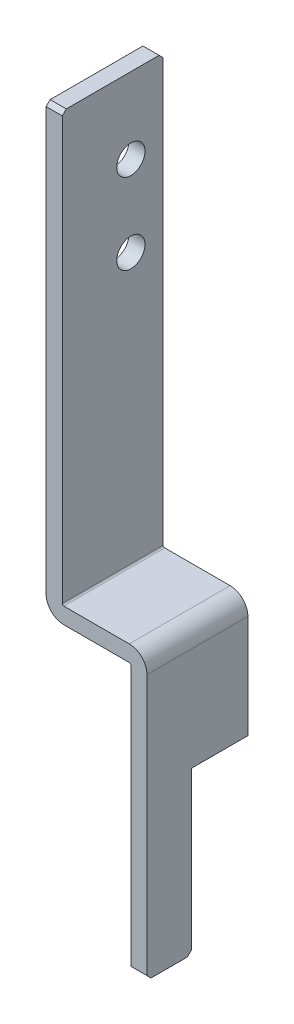
ISO-10303-21;
HEADER;
FILE_DESCRIPTION(('STEP AP214'),'2;1');
FILE_NAME('part.step','',(''),(''),'','','');
FILE_SCHEMA(('AUTOMOTIVE_DESIGN { 1 0 10303 214 1 1 1 1 }'));
ENDSEC;
DATA;
#1=APPLICATION_CONTEXT('core data for automotive mechanical design processes');
#2=APPLICATION_PROTOCOL_DEFINITION('international standard','automotive_design',2000,#1);
#3=PRODUCT_CONTEXT('',#1,'mechanical');
#4=PRODUCT('Part','Part','',(#3));
#5=PRODUCT_RELATED_PRODUCT_CATEGORY('part','',(#4));
#6=PRODUCT_DEFINITION_FORMATION('','',#4);
#7=PRODUCT_DEFINITION_CONTEXT('part definition',#1,'design');
#8=PRODUCT_DEFINITION('design','',#6,#7);
#9=PRODUCT_DEFINITION_SHAPE('','',#8);
#10=(LENGTH_UNIT() NAMED_UNIT(*) SI_UNIT(.MILLI.,.METRE.));
#11=(NAMED_UNIT(*) PLANE_ANGLE_UNIT() SI_UNIT($,.RADIAN.));
#12=(NAMED_UNIT(*) SI_UNIT($,.STERADIAN.) SOLID_ANGLE_UNIT());
#13=UNCERTAINTY_MEASURE_WITH_UNIT(LENGTH_MEASURE(1.E-05),#10,'distance_accuracy_value','');
#14=(GEOMETRIC_REPRESENTATION_CONTEXT(3) GLOBAL_UNCERTAINTY_ASSIGNED_CONTEXT((#13)) GLOBAL_UNIT_ASSIGNED_CONTEXT((#10,
#11,#12)) REPRESENTATION_CONTEXT('',''));
#15=CARTESIAN_POINT('',(0.,0.,0.));
#16=DIRECTION('',(0.,0.,1.));
#17=DIRECTION('',(1.,0.,0.));
#18=AXIS2_PLACEMENT_3D('',#15,#16,#17);
#19=CARTESIAN_POINT('',(18.5,-57.5,2.));
#20=DIRECTION('',(0.,-0.707106781186537,-0.707106781186558));
#21=DIRECTION('',(0.,0.707106781186558,-0.707106781186537));
#22=AXIS2_PLACEMENT_3D('',#19,#20,#21);
#23=PLANE('',#22);
#24=DIRECTION('',(0.,0.707106781186557,-0.707106781186538));
#25=VECTOR('',#24,1.);
#26=CARTESIAN_POINT('',(8.49999999999999,-58.,2.49999999999997));
#27=LINE('',#26,#25);
#28=CARTESIAN_POINT('',(8.49999999999999,-58.,2.49999999999997));
#29=VERTEX_POINT('',#28);
#30=CARTESIAN_POINT('',(8.49999999999999,-57.5,2.));
#31=VERTEX_POINT('',#30);
#32=EDGE_CURVE('E272',#29,#31,#27,.T.);
#33=ORIENTED_EDGE('',*,*,#32,.T.);
#34=DIRECTION('',(1.,0.,0.));
#35=VECTOR('',#34,1.);
#36=CARTESIAN_POINT('',(18.5,-57.5,2.));
#37=LINE('',#36,#35);
#38=CARTESIAN_POINT('',(10.5,-57.5,2.));
#39=VERTEX_POINT('',#38);
#40=EDGE_CURVE('E255',#31,#39,#37,.T.);
#41=ORIENTED_EDGE('',*,*,#40,.T.);
#42=DIRECTION('',(0.,0.707106781186558,-0.707106781186537));
#43=VECTOR('',#42,1.);
#44=CARTESIAN_POINT('',(10.5,-57.5,2.));
#45=LINE('',#44,#43);
#46=CARTESIAN_POINT('',(10.5,-58.,2.49999999999997));
#47=VERTEX_POINT('',#46);
#48=EDGE_CURVE('E268',#39,#47,#45,.F.);
#49=ORIENTED_EDGE('',*,*,#48,.T.);
#50=DIRECTION('',(1.,0.,0.));
#51=VECTOR('',#50,1.);
#52=CARTESIAN_POINT('',(10.5,-58.,2.49999999999997));
#53=LINE('',#52,#51);
#54=EDGE_CURVE('E287',#29,#47,#53,.T.);
#55=ORIENTED_EDGE('',*,*,#54,.F.);
#56=EDGE_LOOP('',(#33,#41,#49,#55));
#57=FACE_BOUND('',#56,.T.);
#58=ADVANCED_FACE('F17',(#57),#23,.T.);
#59=CARTESIAN_POINT('',(10.5,-58.,7.));
#60=DIRECTION('',(0.,0.707106781186543,-0.707106781186552));
#61=DIRECTION('',(0.,0.707106781186552,0.707106781186543));
#62=AXIS2_PLACEMENT_3D('',#59,#60,#61);
#63=PLANE('',#62);
#64=DIRECTION('',(1.,0.,0.));
#65=VECTOR('',#64,1.);
#66=CARTESIAN_POINT('',(10.5,-57.5,7.5));
#67=LINE('',#66,#65);
#68=CARTESIAN_POINT('',(8.49999999999999,-57.5,7.49999999999999));
#69=VERTEX_POINT('',#68);
#70=CARTESIAN_POINT('',(10.5,-57.5,7.5));
#71=VERTEX_POINT('',#70);
#72=EDGE_CURVE('E150',#69,#71,#67,.T.);
#73=ORIENTED_EDGE('',*,*,#72,.F.);
#74=DIRECTION('',(0.,-0.707106781186552,-0.707106781186542));
#75=VECTOR('',#74,1.);
#76=CARTESIAN_POINT('',(8.49999999999999,-57.5,7.5));
#77=LINE('',#76,#75);
#78=CARTESIAN_POINT('',(8.49999999999999,-58.,7.));
#79=VERTEX_POINT('',#78);
#80=EDGE_CURVE('E145',#69,#79,#77,.T.);
#81=ORIENTED_EDGE('',*,*,#80,.T.);
#82=DIRECTION('',(1.,0.,0.));
#83=VECTOR('',#82,1.);
#84=CARTESIAN_POINT('',(10.5,-58.,7.));
#85=LINE('',#84,#83);
#86=CARTESIAN_POINT('',(10.5,-58.,7.));
#87=VERTEX_POINT('',#86);
#88=EDGE_CURVE('E277',#87,#79,#85,.F.);
#89=ORIENTED_EDGE('',*,*,#88,.F.);
#90=DIRECTION('',(0.,0.707106781186552,0.707106781186543));
#91=VECTOR('',#90,1.);
#92=CARTESIAN_POINT('',(10.5,-58.,7.));
#93=LINE('',#92,#91);
#94=EDGE_CURVE('E266',#71,#87,#93,.F.);
#95=ORIENTED_EDGE('',*,*,#94,.F.);
#96=EDGE_LOOP('',(#73,#81,#89,#95));
#97=FACE_BOUND('',#96,.T.);
#98=ADVANCED_FACE('F300',(#97),#63,.F.);
#99=CARTESIAN_POINT('',(8.5,0.,0.));
#100=DIRECTION('',(1.,0.,0.));
#101=DIRECTION('',(0.,1.,0.));
#102=AXIS2_PLACEMENT_3D('',#99,#100,#101);
#103=PLANE('',#102);
#104=ORIENTED_EDGE('',*,*,#32,.F.);
#105=DIRECTION('',(0.,0.,1.));
#106=VECTOR('',#105,1.);
#107=CARTESIAN_POINT('',(8.49999999999999,-58.,5.));
#108=LINE('',#107,#106);
#109=EDGE_CURVE('E284',#79,#29,#108,.F.);
#110=ORIENTED_EDGE('',*,*,#109,.F.);
#111=ORIENTED_EDGE('',*,*,#80,.F.);
#112=DIRECTION('',(0.,1.,0.));
#113=VECTOR('',#112,1.);
#114=CARTESIAN_POINT('',(8.49999999999999,-25.,7.5));
#115=LINE('',#114,#113);
#116=CARTESIAN_POINT('',(8.49999999999999,-25.2,7.5));
#117=VERTEX_POINT('',#116);
#118=EDGE_CURVE('E138',#117,#69,#115,.F.);
#119=ORIENTED_EDGE('',*,*,#118,.F.);
#120=DIRECTION('',(0.,0.,1.));
#121=VECTOR('',#120,1.);
#122=CARTESIAN_POINT('',(8.49999999999999,-25.2,5.));
#123=LINE('',#122,#121);
#124=CARTESIAN_POINT('',(8.49999999999999,-25.2,-5.));
#125=VERTEX_POINT('',#124);
#126=EDGE_CURVE('E142',#117,#125,#123,.F.);
#127=ORIENTED_EDGE('',*,*,#126,.T.);
#128=DIRECTION('',(0.,1.,0.));
#129=VECTOR('',#128,1.);
#130=CARTESIAN_POINT('',(8.49999999999999,-58.,-5.));
#131=LINE('',#130,#129);
#132=CARTESIAN_POINT('',(8.49999999999999,-38.,-5.));
#133=VERTEX_POINT('',#132);
#134=EDGE_CURVE('E160',#133,#125,#131,.T.);
#135=ORIENTED_EDGE('',*,*,#134,.F.);
#136=DIRECTION('',(0.,0.,1.));
#137=VECTOR('',#136,1.);
#138=CARTESIAN_POINT('',(8.49999999999999,-38.,2.));
#139=LINE('',#138,#137);
#140=CARTESIAN_POINT('',(8.49999999999999,-38.,2.));
#141=VERTEX_POINT('',#140);
#142=EDGE_CURVE('E250',#133,#141,#139,.T.);
#143=ORIENTED_EDGE('',*,*,#142,.T.);
#144=DIRECTION('',(0.,-1.,0.));
#145=VECTOR('',#144,1.);
#146=CARTESIAN_POINT('',(8.49999999999999,-38.,2.));
#147=LINE('',#146,#145);
#148=EDGE_CURVE('E258',#141,#31,#147,.T.);
#149=ORIENTED_EDGE('',*,*,#148,.T.);
#150=EDGE_LOOP('',(#104,#110,#111,#119,#127,#135,#143,#149));
#151=FACE_BOUND('',#150,.T.);
#152=ADVANCED_FACE('F140',(#151),#103,.F.);
#153=CARTESIAN_POINT('',(10.5,-58.,5.));
#154=DIRECTION('',(0.,-1.,0.));
#155=DIRECTION('',(1.,0.,0.));
#156=AXIS2_PLACEMENT_3D('',#153,#154,#155);
#157=PLANE('',#156);
#158=DIRECTION('',(0.,0.,1.));
#159=VECTOR('',#158,1.);
#160=CARTESIAN_POINT('',(10.5,-58.,0.));
#161=LINE('',#160,#159);
#162=EDGE_CURVE('E167',#87,#47,#161,.F.);
#163=ORIENTED_EDGE('',*,*,#162,.F.);
#164=ORIENTED_EDGE('',*,*,#88,.T.);
#165=ORIENTED_EDGE('',*,*,#109,.T.);
#166=ORIENTED_EDGE('',*,*,#54,.T.);
#167=EDGE_LOOP('',(#163,#164,#165,#166));
#168=FACE_BOUND('',#167,.T.);
#169=ADVANCED_FACE('F298',(#168),#157,.T.);
#170=CARTESIAN_POINT('',(18.5,-38.,2.));
#171=DIRECTION('',(0.,0.,1.));
#172=DIRECTION('',(0.,-1.,0.));
#173=AXIS2_PLACEMENT_3D('',#170,#171,#172);
#174=PLANE('',#173);
#175=ORIENTED_EDGE('',*,*,#40,.F.);
#176=ORIENTED_EDGE('',*,*,#148,.F.);
#177=DIRECTION('',(-1.,0.,0.));
#178=VECTOR('',#177,1.);
#179=CARTESIAN_POINT('',(18.5,-38.,2.));
#180=LINE('',#179,#178);
#181=CARTESIAN_POINT('',(10.5,-38.,2.));
#182=VERTEX_POINT('',#181);
#183=EDGE_CURVE('E151',#141,#182,#180,.F.);
#184=ORIENTED_EDGE('',*,*,#183,.T.);
#185=DIRECTION('',(0.,1.,0.));
#186=VECTOR('',#185,1.);
#187=CARTESIAN_POINT('',(10.5,0.,2.));
#188=LINE('',#187,#186);
#189=EDGE_CURVE('E169',#39,#182,#188,.T.);
#190=ORIENTED_EDGE('',*,*,#189,.F.);
#191=EDGE_LOOP('',(#175,#176,#184,#190));
#192=FACE_BOUND('',#191,.T.);
#193=ADVANCED_FACE('F309',(#192),#174,.F.);
#194=CARTESIAN_POINT('',(18.5,-38.,2.));
#195=DIRECTION('',(0.,1.,0.));
#196=DIRECTION('',(-1.,0.,0.));
#197=AXIS2_PLACEMENT_3D('',#194,#195,#196);
#198=PLANE('',#197);
#199=DIRECTION('',(0.,0.,1.));
#200=VECTOR('',#199,1.);
#201=CARTESIAN_POINT('',(10.5,-38.,0.));
#202=LINE('',#201,#200);
#203=CARTESIAN_POINT('',(10.5,-38.,-5.));
#204=VERTEX_POINT('',#203);
#205=EDGE_CURVE('E174',#182,#204,#202,.F.);
#206=ORIENTED_EDGE('',*,*,#205,.F.);
#207=ORIENTED_EDGE('',*,*,#183,.F.);
#208=ORIENTED_EDGE('',*,*,#142,.F.);
#209=DIRECTION('',(1.,0.,0.));
#210=VECTOR('',#209,1.);
#211=CARTESIAN_POINT('',(10.5,-38.,-5.));
#212=LINE('',#211,#210);
#213=EDGE_CURVE('E235',#204,#133,#212,.F.);
#214=ORIENTED_EDGE('',*,*,#213,.F.);
#215=EDGE_LOOP('',(#206,#207,#208,#214));
#216=FACE_BOUND('',#215,.T.);
#217=ADVANCED_FACE('F312',(#216),#198,.F.);
#218=CARTESIAN_POINT('',(8.3,-25.2,5.));
#219=DIRECTION('',(0.,0.,1.));
#220=DIRECTION('',(1.,0.,0.));
#221=AXIS2_PLACEMENT_3D('',#218,#219,#220);
#222=CYLINDRICAL_SURFACE('',#221,0.199999999999999);
#223=CARTESIAN_POINT('',(8.3,-25.2,-5.));
#224=DIRECTION('',(0.,0.,1.));
#225=DIRECTION('',(1.,0.,0.));
#226=AXIS2_PLACEMENT_3D('',#223,#224,#225);
#227=CIRCLE('',#226,0.199999999999999);
#228=CARTESIAN_POINT('',(8.3,-25.,-5.));
#229=VERTEX_POINT('',#228);
#230=EDGE_CURVE('E159',#125,#229,#227,.T.);
#231=ORIENTED_EDGE('',*,*,#230,.F.);
#232=ORIENTED_EDGE('',*,*,#126,.F.);
#233=CARTESIAN_POINT('',(8.3,-25.2,7.5));
#234=DIRECTION('',(0.,0.,1.));
#235=DIRECTION('',(1.,0.,0.));
#236=AXIS2_PLACEMENT_3D('',#233,#234,#235);
#237=CIRCLE('',#236,0.199999999999999);
#238=CARTESIAN_POINT('',(8.3,-25.,7.5));
#239=VERTEX_POINT('',#238);
#240=EDGE_CURVE('E20',#117,#239,#237,.T.);
#241=ORIENTED_EDGE('',*,*,#240,.T.);
#242=DIRECTION('',(0.,0.,1.));
#243=VECTOR('',#242,1.);
#244=CARTESIAN_POINT('',(8.3,-25.,0.));
#245=LINE('',#244,#243);
#246=EDGE_CURVE('E218',#229,#239,#245,.T.);
#247=ORIENTED_EDGE('',*,*,#246,.F.);
#248=EDGE_LOOP('',(#231,#232,#241,#247));
#249=FACE_BOUND('',#248,.T.);
#250=ADVANCED_FACE('F156',(#249),#222,.F.);
#251=CARTESIAN_POINT('',(10.5,0.,0.));
#252=DIRECTION('',(1.,0.,0.));
#253=DIRECTION('',(0.,1.,0.));
#254=AXIS2_PLACEMENT_3D('',#251,#252,#253);
#255=PLANE('',#254);
#256=DIRECTION('',(0.,1.,0.));
#257=VECTOR('',#256,1.);
#258=CARTESIAN_POINT('',(10.5,0.,7.5));
#259=LINE('',#258,#257);
#260=CARTESIAN_POINT('',(10.5,-25.2,7.5));
#261=VERTEX_POINT('',#260);
#262=EDGE_CURVE('E219',#261,#71,#259,.F.);
#263=ORIENTED_EDGE('',*,*,#262,.T.);
#264=ORIENTED_EDGE('',*,*,#94,.T.);
#265=ORIENTED_EDGE('',*,*,#162,.T.);
#266=ORIENTED_EDGE('',*,*,#48,.F.);
#267=ORIENTED_EDGE('',*,*,#189,.T.);
#268=ORIENTED_EDGE('',*,*,#205,.T.);
#269=DIRECTION('',(0.,1.,0.));
#270=VECTOR('',#269,1.);
#271=CARTESIAN_POINT('',(10.5,0.,-5.));
#272=LINE('',#271,#270);
#273=CARTESIAN_POINT('',(10.5,-25.2,-5.));
#274=VERTEX_POINT('',#273);
#275=EDGE_CURVE('E225',#204,#274,#272,.T.);
#276=ORIENTED_EDGE('',*,*,#275,.T.);
#277=DIRECTION('',(0.,0.,1.));
#278=VECTOR('',#277,1.);
#279=CARTESIAN_POINT('',(10.5,-25.2,5.));
#280=LINE('',#279,#278);
#281=EDGE_CURVE('E215',#261,#274,#280,.F.);
#282=ORIENTED_EDGE('',*,*,#281,.F.);
#283=EDGE_LOOP('',(#263,#264,#265,#266,#267,#268,#276,#282));
#284=FACE_BOUND('',#283,.T.);
#285=ADVANCED_FACE('F306',(#284),#255,.T.);
#286=CARTESIAN_POINT('',(0.,-25.,0.));
#287=DIRECTION('',(0.,-1.,0.));
#288=DIRECTION('',(1.,0.,0.));
#289=AXIS2_PLACEMENT_3D('',#286,#287,#288);
#290=PLANE('',#289);
#291=DIRECTION('',(1.,0.,0.));
#292=VECTOR('',#291,1.);
#293=CARTESIAN_POINT('',(10.5,-25.,7.5));
#294=LINE('',#293,#292);
#295=CARTESIAN_POINT('',(0.199999999999996,-25.,7.5));
#296=VERTEX_POINT('',#295);
#297=EDGE_CURVE('E166',#296,#239,#294,.T.);
#298=ORIENTED_EDGE('',*,*,#297,.F.);
#299=DIRECTION('',(0.,0.,-1.));
#300=VECTOR('',#299,1.);
#301=CARTESIAN_POINT('',(0.199999999999992,-25.,-5.));
#302=LINE('',#301,#300);
#303=CARTESIAN_POINT('',(0.199999999999996,-25.,-5.));
#304=VERTEX_POINT('',#303);
#305=EDGE_CURVE('E214',#304,#296,#302,.F.);
#306=ORIENTED_EDGE('',*,*,#305,.F.);
#307=DIRECTION('',(-1.,0.,0.));
#308=VECTOR('',#307,1.);
#309=CARTESIAN_POINT('',(0.,-25.,-5.));
#310=LINE('',#309,#308);
#311=EDGE_CURVE('E365',#229,#304,#310,.T.);
#312=ORIENTED_EDGE('',*,*,#311,.F.);
#313=ORIENTED_EDGE('',*,*,#246,.T.);
#314=EDGE_LOOP('',(#298,#306,#312,#313));
#315=FACE_BOUND('',#314,.T.);
#316=ADVANCED_FACE('F427',(#315),#290,.T.);
#317=CARTESIAN_POINT('',(8.3,-25.2,5.));
#318=DIRECTION('',(0.,0.,1.));
#319=DIRECTION('',(1.,0.,0.));
#320=AXIS2_PLACEMENT_3D('',#317,#318,#319);
#321=CYLINDRICAL_SURFACE('',#320,2.2);
#322=ORIENTED_EDGE('',*,*,#281,.T.);
#323=CARTESIAN_POINT('',(8.3,-25.2,-5.));
#324=DIRECTION('',(0.,0.,1.));
#325=DIRECTION('',(1.,0.,0.));
#326=AXIS2_PLACEMENT_3D('',#323,#324,#325);
#327=CIRCLE('',#326,2.2);
#328=CARTESIAN_POINT('',(8.3,-23.,-5.));
#329=VERTEX_POINT('',#328);
#330=EDGE_CURVE('E211',#274,#329,#327,.T.);
#331=ORIENTED_EDGE('',*,*,#330,.T.);
#332=DIRECTION('',(0.,0.,1.));
#333=VECTOR('',#332,1.);
#334=CARTESIAN_POINT('',(8.3,-23.,0.));
#335=LINE('',#334,#333);
#336=CARTESIAN_POINT('',(8.3,-23.,7.5));
#337=VERTEX_POINT('',#336);
#338=EDGE_CURVE('E323',#329,#337,#335,.T.);
#339=ORIENTED_EDGE('',*,*,#338,.T.);
#340=CARTESIAN_POINT('',(8.3,-25.2,7.5));
#341=DIRECTION('',(0.,0.,1.));
#342=DIRECTION('',(1.,0.,0.));
#343=AXIS2_PLACEMENT_3D('',#340,#341,#342);
#344=CIRCLE('',#343,2.2);
#345=EDGE_CURVE('E216',#337,#261,#344,.F.);
#346=ORIENTED_EDGE('',*,*,#345,.T.);
#347=EDGE_LOOP('',(#322,#331,#339,#346));
#348=FACE_BOUND('',#347,.T.);
#349=ADVANCED_FACE('F321',(#348),#321,.T.);
#350=CARTESIAN_POINT('',(0.2,-22.8,-5.));
#351=DIRECTION('',(0.,0.,-1.));
#352=DIRECTION('',(-1.,0.,0.));
#353=AXIS2_PLACEMENT_3D('',#350,#351,#352);
#354=CYLINDRICAL_SURFACE('',#353,2.2);
#355=ORIENTED_EDGE('',*,*,#305,.T.);
#356=CARTESIAN_POINT('',(0.2,-22.8,7.5));
#357=DIRECTION('',(0.,0.,-1.));
#358=DIRECTION('',(-1.,0.,0.));
#359=AXIS2_PLACEMENT_3D('',#356,#357,#358);
#360=CIRCLE('',#359,2.2);
#361=CARTESIAN_POINT('',(-2.,-22.8,7.5));
#362=VERTEX_POINT('',#361);
#363=EDGE_CURVE('E205',#362,#296,#360,.F.);
#364=ORIENTED_EDGE('',*,*,#363,.F.);
#365=DIRECTION('',(0.,0.,-1.));
#366=VECTOR('',#365,1.);
#367=CARTESIAN_POINT('',(-2.,-22.8,0.));
#368=LINE('',#367,#366);
#369=CARTESIAN_POINT('',(-2.,-22.8,-5.));
#370=VERTEX_POINT('',#369);
#371=EDGE_CURVE('E355',#362,#370,#368,.T.);
#372=ORIENTED_EDGE('',*,*,#371,.T.);
#373=CARTESIAN_POINT('',(0.2,-22.8,-5.));
#374=DIRECTION('',(0.,0.,-1.));
#375=DIRECTION('',(-1.,0.,0.));
#376=AXIS2_PLACEMENT_3D('',#373,#374,#375);
#377=CIRCLE('',#376,2.2);
#378=EDGE_CURVE('E201',#370,#304,#377,.F.);
#379=ORIENTED_EDGE('',*,*,#378,.T.);
#380=EDGE_LOOP('',(#355,#364,#372,#379));
#381=FACE_BOUND('',#380,.T.);
#382=ADVANCED_FACE('F421',(#381),#354,.T.);
#383=CARTESIAN_POINT('',(-2.,30.,7.));
#384=DIRECTION('',(0.,-0.707106781186548,-0.707106781186548));
#385=DIRECTION('',(0.,0.707106781186548,-0.707106781186548));
#386=AXIS2_PLACEMENT_3D('',#383,#384,#385);
#387=PLANE('',#386);
#388=DIRECTION('',(1.,0.,0.));
#389=VECTOR('',#388,1.);
#390=CARTESIAN_POINT('',(-2.,29.5,7.50000000000001));
#391=LINE('',#390,#389);
#392=CARTESIAN_POINT('',(0.,29.5,7.50000000000001));
#393=VERTEX_POINT('',#392);
#394=CARTESIAN_POINT('',(-2.,29.5,7.50000000000001));
#395=VERTEX_POINT('',#394);
#396=EDGE_CURVE('E358',#393,#395,#391,.F.);
#397=ORIENTED_EDGE('',*,*,#396,.F.);
#398=DIRECTION('',(0.,0.707106781186548,-0.707106781186548));
#399=VECTOR('',#398,1.);
#400=CARTESIAN_POINT('',(0.,30.,7.));
#401=LINE('',#400,#399);
#402=CARTESIAN_POINT('',(0.,30.,7.));
#403=VERTEX_POINT('',#402);
#404=EDGE_CURVE('E210',#403,#393,#401,.F.);
#405=ORIENTED_EDGE('',*,*,#404,.F.);
#406=DIRECTION('',(1.,0.,0.));
#407=VECTOR('',#406,1.);
#408=CARTESIAN_POINT('',(-2.,30.,7.));
#409=LINE('',#408,#407);
#410=CARTESIAN_POINT('',(-2.,30.,7.00000000000001));
#411=VERTEX_POINT('',#410);
#412=EDGE_CURVE('E373',#411,#403,#409,.T.);
#413=ORIENTED_EDGE('',*,*,#412,.F.);
#414=DIRECTION('',(0.,-0.707106781186547,0.707106781186548));
#415=VECTOR('',#414,1.);
#416=CARTESIAN_POINT('',(-2.,30.,7.));
#417=LINE('',#416,#415);
#418=EDGE_CURVE('E353',#411,#395,#417,.T.);
#419=ORIENTED_EDGE('',*,*,#418,.T.);
#420=EDGE_LOOP('',(#397,#405,#413,#419));
#421=FACE_BOUND('',#420,.T.);
#422=ADVANCED_FACE('F387',(#421),#387,.F.);
#423=CARTESIAN_POINT('',(0.,-23.,0.));
#424=DIRECTION('',(0.,-1.,0.));
#425=DIRECTION('',(1.,0.,0.));
#426=AXIS2_PLACEMENT_3D('',#423,#424,#425);
#427=PLANE('',#426);
#428=DIRECTION('',(1.,0.,0.));
#429=VECTOR('',#428,1.);
#430=CARTESIAN_POINT('',(0.,-23.,-5.));
#431=LINE('',#430,#429);
#432=CARTESIAN_POINT('',(0.199999999999995,-23.,-5.));
#433=VERTEX_POINT('',#432);
#434=EDGE_CURVE('E330',#433,#329,#431,.T.);
#435=ORIENTED_EDGE('',*,*,#434,.F.);
#436=DIRECTION('',(0.,0.,-1.));
#437=VECTOR('',#436,1.);
#438=CARTESIAN_POINT('',(0.199999999999999,-23.,-5.));
#439=LINE('',#438,#437);
#440=CARTESIAN_POINT('',(0.199999999999997,-23.,7.5));
#441=VERTEX_POINT('',#440);
#442=EDGE_CURVE('E192',#433,#441,#439,.F.);
#443=ORIENTED_EDGE('',*,*,#442,.T.);
#444=DIRECTION('',(1.,0.,0.));
#445=VECTOR('',#444,1.);
#446=CARTESIAN_POINT('',(0.,-23.,7.5));
#447=LINE('',#446,#445);
#448=EDGE_CURVE('E207',#337,#441,#447,.F.);
#449=ORIENTED_EDGE('',*,*,#448,.F.);
#450=ORIENTED_EDGE('',*,*,#338,.F.);
#451=EDGE_LOOP('',(#435,#443,#449,#450));
#452=FACE_BOUND('',#451,.T.);
#453=ADVANCED_FACE('F407',(#452),#427,.F.);
#454=CARTESIAN_POINT('',(-2.,0.,0.));
#455=DIRECTION('',(1.,0.,0.));
#456=DIRECTION('',(0.,0.,-1.));
#457=AXIS2_PLACEMENT_3D('',#454,#455,#456);
#458=PLANE('',#457);
#459=ORIENTED_EDGE('',*,*,#418,.F.);
#460=DIRECTION('',(0.,0.,1.));
#461=VECTOR('',#460,1.);
#462=CARTESIAN_POINT('',(-2.,30.,5.));
#463=LINE('',#462,#461);
#464=CARTESIAN_POINT('',(-2.,30.,-4.49999999999997));
#465=VERTEX_POINT('',#464);
#466=EDGE_CURVE('E197',#465,#411,#463,.T.);
#467=ORIENTED_EDGE('',*,*,#466,.F.);
#468=DIRECTION('',(0.,-0.707106781186538,-0.707106781186557));
#469=VECTOR('',#468,1.);
#470=CARTESIAN_POINT('',(-2.,29.5,-5.));
#471=LINE('',#470,#469);
#472=CARTESIAN_POINT('',(-2.,29.5,-5.));
#473=VERTEX_POINT('',#472);
#474=EDGE_CURVE('E204',#465,#473,#471,.T.);
#475=ORIENTED_EDGE('',*,*,#474,.T.);
#476=DIRECTION('',(0.,1.,0.));
#477=VECTOR('',#476,1.);
#478=CARTESIAN_POINT('',(-2.,30.,-5.));
#479=LINE('',#478,#477);
#480=EDGE_CURVE('E599',#370,#473,#479,.T.);
#481=ORIENTED_EDGE('',*,*,#480,.F.);
#482=ORIENTED_EDGE('',*,*,#371,.F.);
#483=DIRECTION('',(0.,-1.,0.));
#484=VECTOR('',#483,1.);
#485=CARTESIAN_POINT('',(-2.,30.,7.50000000000001));
#486=LINE('',#485,#484);
#487=EDGE_CURVE('E193',#395,#362,#486,.T.);
#488=ORIENTED_EDGE('',*,*,#487,.F.);
#489=EDGE_LOOP('',(#459,#467,#475,#481,#482,#488));
#490=FACE_BOUND('',#489,.T.);
#491=CARTESIAN_POINT('',(-2.,20.6000000000001,-0.999999999999987));
#492=DIRECTION('',(-1.,0.,0.));
#493=DIRECTION('',(0.,0.,1.));
#494=AXIS2_PLACEMENT_3D('',#491,#492,#493);
#495=CIRCLE('',#494,1.75);
#496=CARTESIAN_POINT('',(-2.,20.6000000000001,0.750000000000013));
#497=VERTEX_POINT('',#496);
#498=EDGE_CURVE('E194',#497,#497,#495,.F.);
#499=ORIENTED_EDGE('',*,*,#498,.T.);
#500=EDGE_LOOP('',(#499));
#501=FACE_BOUND('',#500,.T.);
#502=CARTESIAN_POINT('',(-2.,10.6000000000001,-0.999999999999987));
#503=DIRECTION('',(-1.,0.,0.));
#504=DIRECTION('',(0.,0.,1.));
#505=AXIS2_PLACEMENT_3D('',#502,#503,#504);
#506=CIRCLE('',#505,1.75);
#507=CARTESIAN_POINT('',(-2.,10.6000000000001,0.750000000000013));
#508=VERTEX_POINT('',#507);
#509=EDGE_CURVE('E198',#508,#508,#506,.F.);
#510=ORIENTED_EDGE('',*,*,#509,.T.);
#511=EDGE_LOOP('',(#510));
#512=FACE_BOUND('',#511,.T.);
#513=ADVANCED_FACE('F405',(#490,#501,#512),#458,.F.);
#514=CARTESIAN_POINT('',(-2.,29.5,-5.));
#515=DIRECTION('',(0.,-0.707106781186557,0.707106781186538));
#516=DIRECTION('',(0.,-0.707106781186538,-0.707106781186557));
#517=AXIS2_PLACEMENT_3D('',#514,#515,#516);
#518=PLANE('',#517);
#519=DIRECTION('',(1.,0.,0.));
#520=VECTOR('',#519,1.);
#521=CARTESIAN_POINT('',(-2.,30.,-4.49999999999997));
#522=LINE('',#521,#520);
#523=CARTESIAN_POINT('',(0.,30.,-4.49999999999997));
#524=VERTEX_POINT('',#523);
#525=EDGE_CURVE('E361',#524,#465,#522,.F.);
#526=ORIENTED_EDGE('',*,*,#525,.F.);
#527=DIRECTION('',(0.,-0.707106781186538,-0.707106781186557));
#528=VECTOR('',#527,1.);
#529=CARTESIAN_POINT('',(0.,29.5,-5.));
#530=LINE('',#529,#528);
#531=CARTESIAN_POINT('',(0.,29.5,-5.));
#532=VERTEX_POINT('',#531);
#533=EDGE_CURVE('E35',#532,#524,#530,.F.);
#534=ORIENTED_EDGE('',*,*,#533,.F.);
#535=DIRECTION('',(1.,0.,0.));
#536=VECTOR('',#535,1.);
#537=CARTESIAN_POINT('',(-2.,29.5,-5.));
#538=LINE('',#537,#536);
#539=EDGE_CURVE('E189',#473,#532,#538,.T.);
#540=ORIENTED_EDGE('',*,*,#539,.F.);
#541=ORIENTED_EDGE('',*,*,#474,.F.);
#542=EDGE_LOOP('',(#526,#534,#540,#541));
#543=FACE_BOUND('',#542,.T.);
#544=ADVANCED_FACE('F401',(#543),#518,.F.);
#545=CARTESIAN_POINT('',(8.,10.6000000000001,-0.999999999999987));
#546=DIRECTION('',(-1.,0.,0.));
#547=DIRECTION('',(0.,0.,1.));
#548=AXIS2_PLACEMENT_3D('',#545,#546,#547);
#549=CYLINDRICAL_SURFACE('',#548,1.75);
#550=CARTESIAN_POINT('',(0.,10.6000000000001,-0.999999999999987));
#551=DIRECTION('',(-1.,0.,0.));
#552=DIRECTION('',(0.,0.,1.));
#553=AXIS2_PLACEMENT_3D('',#550,#551,#552);
#554=CIRCLE('',#553,1.75);
#555=CARTESIAN_POINT('',(0.,10.6000000000001,0.750000000000013));
#556=VERTEX_POINT('',#555);
#557=EDGE_CURVE('E186',#556,#556,#554,.T.);
#558=ORIENTED_EDGE('',*,*,#557,.F.);
#559=EDGE_LOOP('',(#558));
#560=FACE_BOUND('',#559,.T.);
#561=ORIENTED_EDGE('',*,*,#509,.F.);
#562=EDGE_LOOP('',(#561));
#563=FACE_BOUND('',#562,.T.);
#564=ADVANCED_FACE('F397',(#560,#563),#549,.F.);
#565=CARTESIAN_POINT('',(8.,20.6000000000001,-0.999999999999987));
#566=DIRECTION('',(-1.,0.,0.));
#567=DIRECTION('',(0.,0.,1.));
#568=AXIS2_PLACEMENT_3D('',#565,#566,#567);
#569=CYLINDRICAL_SURFACE('',#568,1.75);
#570=CARTESIAN_POINT('',(0.,20.6000000000001,-0.999999999999987));
#571=DIRECTION('',(-1.,0.,0.));
#572=DIRECTION('',(0.,0.,1.));
#573=AXIS2_PLACEMENT_3D('',#570,#571,#572);
#574=CIRCLE('',#573,1.75);
#575=CARTESIAN_POINT('',(0.,20.6000000000001,0.750000000000013));
#576=VERTEX_POINT('',#575);
#577=EDGE_CURVE('E182',#576,#576,#574,.T.);
#578=ORIENTED_EDGE('',*,*,#577,.F.);
#579=EDGE_LOOP('',(#578));
#580=FACE_BOUND('',#579,.T.);
#581=ORIENTED_EDGE('',*,*,#498,.F.);
#582=EDGE_LOOP('',(#581));
#583=FACE_BOUND('',#582,.T.);
#584=ADVANCED_FACE('F400',(#580,#583),#569,.F.);
#585=CARTESIAN_POINT('',(-2.,30.,5.));
#586=DIRECTION('',(0.,1.,0.));
#587=DIRECTION('',(0.,0.,1.));
#588=AXIS2_PLACEMENT_3D('',#585,#586,#587);
#589=PLANE('',#588);
#590=DIRECTION('',(0.,0.,-1.));
#591=VECTOR('',#590,1.);
#592=CARTESIAN_POINT('',(0.,30.,0.));
#593=LINE('',#592,#591);
#594=EDGE_CURVE('E185',#524,#403,#593,.F.);
#595=ORIENTED_EDGE('',*,*,#594,.F.);
#596=ORIENTED_EDGE('',*,*,#525,.T.);
#597=ORIENTED_EDGE('',*,*,#466,.T.);
#598=ORIENTED_EDGE('',*,*,#412,.T.);
#599=EDGE_LOOP('',(#595,#596,#597,#598));
#600=FACE_BOUND('',#599,.T.);
#601=ADVANCED_FACE('F384',(#600),#589,.T.);
#602=CARTESIAN_POINT('',(-2.,30.,7.50000000000001));
#603=DIRECTION('',(0.,0.,1.));
#604=DIRECTION('',(0.,-1.,0.));
#605=AXIS2_PLACEMENT_3D('',#602,#603,#604);
#606=PLANE('',#605);
#607=ORIENTED_EDGE('',*,*,#487,.T.);
#608=ORIENTED_EDGE('',*,*,#363,.T.);
#609=ORIENTED_EDGE('',*,*,#297,.T.);
#610=ORIENTED_EDGE('',*,*,#240,.F.);
#611=ORIENTED_EDGE('',*,*,#118,.T.);
#612=ORIENTED_EDGE('',*,*,#72,.T.);
#613=ORIENTED_EDGE('',*,*,#262,.F.);
#614=ORIENTED_EDGE('',*,*,#345,.F.);
#615=ORIENTED_EDGE('',*,*,#448,.T.);
#616=CARTESIAN_POINT('',(0.2,-22.8,7.5));
#617=DIRECTION('',(0.,0.,-1.));
#618=DIRECTION('',(-1.,0.,0.));
#619=AXIS2_PLACEMENT_3D('',#616,#617,#618);
#620=CIRCLE('',#619,0.199999999999999);
#621=CARTESIAN_POINT('',(0.,-22.8,7.5));
#622=VERTEX_POINT('',#621);
#623=EDGE_CURVE('E208',#441,#622,#620,.T.);
#624=ORIENTED_EDGE('',*,*,#623,.T.);
#625=DIRECTION('',(0.,1.,0.));
#626=VECTOR('',#625,1.);
#627=CARTESIAN_POINT('',(0.,0.,7.50000000000001));
#628=LINE('',#627,#626);
#629=EDGE_CURVE('E339',#393,#622,#628,.F.);
#630=ORIENTED_EDGE('',*,*,#629,.F.);
#631=ORIENTED_EDGE('',*,*,#396,.T.);
#632=EDGE_LOOP('',(#607,#608,#609,#610,#611,#612,#613,#614,#615,#624,#630,#631));
#633=FACE_BOUND('',#632,.T.);
#634=ADVANCED_FACE('F164',(#633),#606,.T.);
#635=CARTESIAN_POINT('',(0.2,-22.8,-5.));
#636=DIRECTION('',(0.,0.,-1.));
#637=DIRECTION('',(-1.,0.,0.));
#638=AXIS2_PLACEMENT_3D('',#635,#636,#637);
#639=CYLINDRICAL_SURFACE('',#638,0.199999999999999);
#640=ORIENTED_EDGE('',*,*,#623,.F.);
#641=ORIENTED_EDGE('',*,*,#442,.F.);
#642=CARTESIAN_POINT('',(0.2,-22.8,-5.));
#643=DIRECTION('',(0.,0.,-1.));
#644=DIRECTION('',(-1.,0.,0.));
#645=AXIS2_PLACEMENT_3D('',#642,#643,#644);
#646=CIRCLE('',#645,0.199999999999999);
#647=CARTESIAN_POINT('',(0.,-22.8,-5.));
#648=VERTEX_POINT('',#647);
#649=EDGE_CURVE('E190',#648,#433,#646,.F.);
#650=ORIENTED_EDGE('',*,*,#649,.F.);
#651=DIRECTION('',(0.,0.,-1.));
#652=VECTOR('',#651,1.);
#653=CARTESIAN_POINT('',(0.,-22.8,0.));
#654=LINE('',#653,#652);
#655=EDGE_CURVE('E26',#622,#648,#654,.T.);
#656=ORIENTED_EDGE('',*,*,#655,.F.);
#657=EDGE_LOOP('',(#640,#641,#650,#656));
#658=FACE_BOUND('',#657,.T.);
#659=ADVANCED_FACE('F568',(#658),#639,.F.);
#660=CARTESIAN_POINT('',(-2.,30.,-5.));
#661=DIRECTION('',(0.,0.,-1.));
#662=DIRECTION('',(0.,1.,0.));
#663=AXIS2_PLACEMENT_3D('',#660,#661,#662);
#664=PLANE('',#663);
#665=DIRECTION('',(0.,1.,0.));
#666=VECTOR('',#665,1.);
#667=CARTESIAN_POINT('',(0.,0.,-5.));
#668=LINE('',#667,#666);
#669=EDGE_CURVE('E10',#648,#532,#668,.T.);
#670=ORIENTED_EDGE('',*,*,#669,.F.);
#671=ORIENTED_EDGE('',*,*,#649,.T.);
#672=ORIENTED_EDGE('',*,*,#434,.T.);
#673=ORIENTED_EDGE('',*,*,#330,.F.);
#674=ORIENTED_EDGE('',*,*,#275,.F.);
#675=ORIENTED_EDGE('',*,*,#213,.T.);
#676=ORIENTED_EDGE('',*,*,#134,.T.);
#677=ORIENTED_EDGE('',*,*,#230,.T.);
#678=ORIENTED_EDGE('',*,*,#311,.T.);
#679=ORIENTED_EDGE('',*,*,#378,.F.);
#680=ORIENTED_EDGE('',*,*,#480,.T.);
#681=ORIENTED_EDGE('',*,*,#539,.T.);
#682=EDGE_LOOP('',(#670,#671,#672,#673,#674,#675,#676,#677,#678,#679,#680,#681));
#683=FACE_BOUND('',#682,.T.);
#684=ADVANCED_FACE('F316',(#683),#664,.T.);
#685=CARTESIAN_POINT('',(0.,0.,0.));
#686=DIRECTION('',(1.,0.,0.));
#687=DIRECTION('',(0.,0.,-1.));
#688=AXIS2_PLACEMENT_3D('',#685,#686,#687);
#689=PLANE('',#688);
#690=ORIENTED_EDGE('',*,*,#669,.T.);
#691=ORIENTED_EDGE('',*,*,#533,.T.);
#692=ORIENTED_EDGE('',*,*,#594,.T.);
#693=ORIENTED_EDGE('',*,*,#404,.T.);
#694=ORIENTED_EDGE('',*,*,#629,.T.);
#695=ORIENTED_EDGE('',*,*,#655,.T.);
#696=EDGE_LOOP('',(#690,#691,#692,#693,#694,#695));
#697=FACE_BOUND('',#696,.T.);
#698=ORIENTED_EDGE('',*,*,#577,.T.);
#699=EDGE_LOOP('',(#698));
#700=FACE_BOUND('',#699,.T.);
#701=ORIENTED_EDGE('',*,*,#557,.T.);
#702=EDGE_LOOP('',(#701));
#703=FACE_BOUND('',#702,.T.);
#704=ADVANCED_FACE('F389',(#697,#700,#703),#689,.T.);
#705=CLOSED_SHELL('',(#58,#98,#152,#169,#193,#217,#250,#285,#316,#349,#382,#422,#453,#513,#544,
#564,#584,#601,#634,#659,#684,#704));
#706=MANIFOLD_SOLID_BREP('B1',#705);
#707=ADVANCED_BREP_SHAPE_REPRESENTATION('',(#18,#706),#14);
#708=SHAPE_DEFINITION_REPRESENTATION(#9,#707);
ENDSEC;
END-ISO-10303-21;
